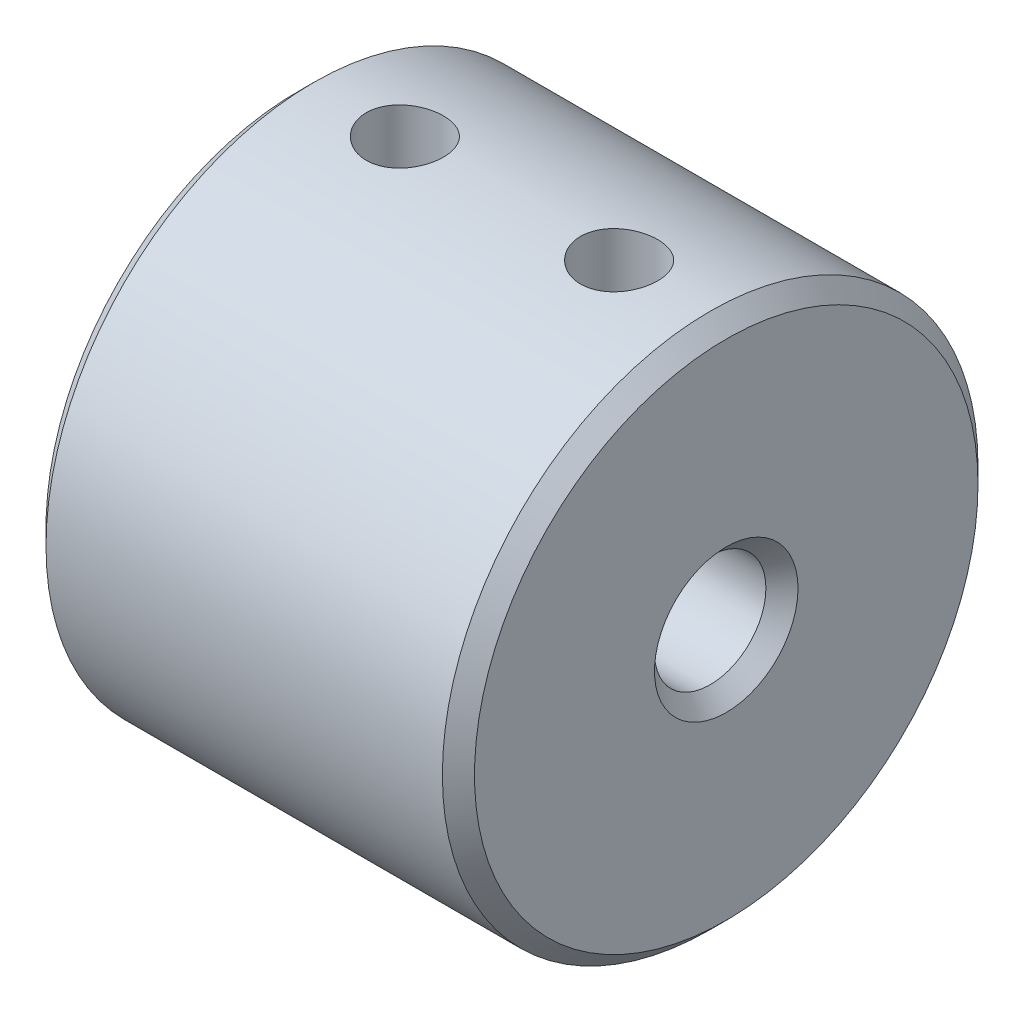
ISO-10303-21;
HEADER;
FILE_DESCRIPTION(('STEP AP214'),'2;1');
FILE_NAME('part.step','',(''),(''),'','','');
FILE_SCHEMA(('AUTOMOTIVE_DESIGN { 1 0 10303 214 1 1 1 1 }'));
ENDSEC;
DATA;
#1=APPLICATION_CONTEXT('core data for automotive mechanical design processes');
#2=APPLICATION_PROTOCOL_DEFINITION('international standard','automotive_design',2000,#1);
#3=PRODUCT_CONTEXT('',#1,'mechanical');
#4=PRODUCT('Part','Part','',(#3));
#5=PRODUCT_RELATED_PRODUCT_CATEGORY('part','',(#4));
#6=PRODUCT_DEFINITION_FORMATION('','',#4);
#7=PRODUCT_DEFINITION_CONTEXT('part definition',#1,'design');
#8=PRODUCT_DEFINITION('design','',#6,#7);
#9=PRODUCT_DEFINITION_SHAPE('','',#8);
#10=(LENGTH_UNIT() NAMED_UNIT(*) SI_UNIT(.MILLI.,.METRE.));
#11=(NAMED_UNIT(*) PLANE_ANGLE_UNIT() SI_UNIT($,.RADIAN.));
#12=(NAMED_UNIT(*) SI_UNIT($,.STERADIAN.) SOLID_ANGLE_UNIT());
#13=UNCERTAINTY_MEASURE_WITH_UNIT(LENGTH_MEASURE(1.E-05),#10,'distance_accuracy_value','');
#14=(GEOMETRIC_REPRESENTATION_CONTEXT(3) GLOBAL_UNCERTAINTY_ASSIGNED_CONTEXT((#13)) GLOBAL_UNIT_ASSIGNED_CONTEXT((#10,
#11,#12)) REPRESENTATION_CONTEXT('',''));
#15=CARTESIAN_POINT('',(0.,0.,0.));
#16=DIRECTION('',(0.,0.,1.));
#17=DIRECTION('',(1.,0.,0.));
#18=AXIS2_PLACEMENT_3D('',#15,#16,#17);
#19=CARTESIAN_POINT('',(20.,0.,0.));
#20=DIRECTION('',(-1.,0.,0.));
#21=DIRECTION('',(0.,0.,1.));
#22=AXIS2_PLACEMENT_3D('',#19,#20,#21);
#23=CYLINDRICAL_SURFACE('',#22,5.1);
#24=CARTESIAN_POINT('',(0.749999999999997,0.,0.));
#25=DIRECTION('',(1.,0.,0.));
#26=DIRECTION('',(0.,0.,-1.));
#27=AXIS2_PLACEMENT_3D('',#24,#25,#26);
#28=CIRCLE('',#27,5.1);
#29=CARTESIAN_POINT('',(0.749999999999997,0.,-5.1));
#30=VERTEX_POINT('',#29);
#31=EDGE_CURVE('E37',#30,#30,#28,.F.);
#32=ORIENTED_EDGE('',*,*,#31,.T.);
#33=EDGE_LOOP('',(#32));
#34=FACE_BOUND('',#33,.T.);
#35=CARTESIAN_POINT('',(9.25,0.,0.));
#36=DIRECTION('',(1.,0.,0.));
#37=DIRECTION('',(0.,0.,-1.));
#38=AXIS2_PLACEMENT_3D('',#35,#36,#37);
#39=CIRCLE('',#38,5.1);
#40=CARTESIAN_POINT('',(9.25,0.,-5.1));
#41=VERTEX_POINT('',#40);
#42=EDGE_CURVE('E41',#41,#41,#39,.T.);
#43=ORIENTED_EDGE('',*,*,#42,.T.);
#44=EDGE_LOOP('',(#43));
#45=FACE_BOUND('',#44,.T.);
#46=CARTESIAN_POINT('',(5.,4.77179211617606,-1.8));
#47=CARTESIAN_POINT('',(5.09766376906023,4.77179057891547,-1.80000178879937));
#48=CARTESIAN_POINT('',(5.19531510071238,4.77482311752795,-1.79202479137536));
#49=CARTESIAN_POINT('',(5.38770107288386,4.78655271745621,-1.7604521109396));
#50=CARTESIAN_POINT('',(5.48243551138635,4.79525017018996,-1.73685534867634));
#51=CARTESIAN_POINT('',(5.66616427458729,4.81720432912199,-1.6749943771612));
#52=CARTESIAN_POINT('',(5.7551704908051,4.83045120290536,-1.63676177927544));
#53=CARTESIAN_POINT('',(5.92553742459657,4.85999662432325,-1.54682439139059));
#54=CARTESIAN_POINT('',(6.00689614701902,4.87629596501395,-1.49511609892422));
#55=CARTESIAN_POINT('',(6.16323280038507,4.91091252917204,-1.37726183158472));
#56=CARTESIAN_POINT('',(6.23782641736017,4.92928432839081,-1.31062195594327));
#57=CARTESIAN_POINT('',(6.37504544253177,4.96551730444401,-1.16584743505897));
#58=CARTESIAN_POINT('',(6.43766865510809,4.98337838709248,-1.08771068569379));
#59=CARTESIAN_POINT('',(6.55096165833392,5.0172170078421,-0.919301355934873));
#60=CARTESIAN_POINT('',(6.60122189316265,5.03312298110544,-0.828737599998519));
#61=CARTESIAN_POINT('',(6.68563854416339,5.06061029961003,-0.639781542154651));
#62=CARTESIAN_POINT('',(6.71979986349648,5.07219296135548,-0.541391634500671));
#63=CARTESIAN_POINT('',(6.76972544942103,5.08934167476699,-0.343610765548326));
#64=CARTESIAN_POINT('',(6.7861495686983,5.0951229131693,-0.244405383305836));
#65=CARTESIAN_POINT('',(6.80224001283133,5.10078507932648,-0.0444894331154103));
#66=CARTESIAN_POINT('',(6.80191116958293,5.10066770836064,0.0562206924563105));
#67=CARTESIAN_POINT('',(6.78490794953763,5.09468764042003,0.251589997503374));
#68=CARTESIAN_POINT('',(6.76895182839163,5.08907740807746,0.346320714918821));
#69=CARTESIAN_POINT('',(6.72234407182109,5.0730654301282,0.531661595570342));
#70=CARTESIAN_POINT('',(6.69169141465815,5.06266335138284,0.622271471836064));
#71=CARTESIAN_POINT('',(6.61618150231363,5.03793183506246,0.79828426091064));
#72=CARTESIAN_POINT('',(6.57113297285803,5.02354988435183,0.883597433211803));
#73=CARTESIAN_POINT('',(6.46827263857434,4.99233681997265,1.04565463246261));
#74=CARTESIAN_POINT('',(6.41045700180277,4.97550497150533,1.12239607624225));
#75=CARTESIAN_POINT('',(6.28015537421303,4.94010823887679,1.26938777545075));
#76=CARTESIAN_POINT('',(6.20705966367074,4.92149875894636,1.33908761593446));
#77=CARTESIAN_POINT('',(6.05007828586402,4.88536984050398,1.465431643673));
#78=CARTESIAN_POINT('',(5.96619051465466,4.86785061553129,1.52207327916357));
#79=CARTESIAN_POINT('',(5.78806896740533,4.83562425411914,1.62158329806663));
#80=CARTESIAN_POINT('',(5.69367851202571,4.82097230408064,1.66419049980235));
#81=CARTESIAN_POINT('',(5.4984119094291,4.79677584952522,1.73270815014938));
#82=CARTESIAN_POINT('',(5.39753890644845,4.78722888956364,1.75862662708267));
#83=CARTESIAN_POINT('',(5.19755484523354,4.77488962427376,1.79185082329929));
#84=CARTESIAN_POINT('',(5.09860658395106,4.77178435305474,1.80001989980664));
#85=CARTESIAN_POINT('',(4.90072568244871,4.7717999024999,1.79998003853999));
#86=CARTESIAN_POINT('',(4.80179304334061,4.77491940899169,1.79177455775547));
#87=CARTESIAN_POINT('',(4.61090101743485,4.78671824614052,1.7599977914987));
#88=CARTESIAN_POINT('',(4.51882111637868,4.79516943997506,1.73705634276769));
#89=CARTESIAN_POINT('',(4.33984623795104,4.81641940967953,1.67723125401985));
#90=CARTESIAN_POINT('',(4.25295225105957,4.82921901296648,1.64034496042185));
#91=CARTESIAN_POINT('',(4.08348796437824,4.85826891941576,1.5522369803934));
#92=CARTESIAN_POINT('',(4.00117030274841,4.87462304828792,1.50056457496746));
#93=CARTESIAN_POINT('',(3.84606442744477,4.90875051605513,1.38484730150454));
#94=CARTESIAN_POINT('',(3.77327935599778,4.92652431982501,1.32079837093017));
#95=CARTESIAN_POINT('',(3.63516216343552,4.96266988139109,1.17797181962988));
#96=CARTESIAN_POINT('',(3.57045969565111,4.98102079897456,1.09857808462835));
#97=CARTESIAN_POINT('',(3.45523934906114,5.01530183353512,0.929606775672224));
#98=CARTESIAN_POINT('',(3.40472117741899,5.03123200048581,0.840029412013589));
#99=CARTESIAN_POINT('',(3.31971988294053,5.05882678928133,0.65352808448695));
#100=CARTESIAN_POINT('',(3.28515084345368,5.07051419209174,0.556646834318194));
#101=CARTESIAN_POINT('',(3.23296441204926,5.08839920368979,0.357945224636596));
#102=CARTESIAN_POINT('',(3.21534006850457,5.09459906368017,0.256126908598063));
#103=CARTESIAN_POINT('',(3.19822709709899,5.10062039901428,0.0561678812904945));
#104=CARTESIAN_POINT('',(3.19783922281879,5.10075813835421,-0.0418871123621515));
#105=CARTESIAN_POINT('',(3.21294855117171,5.09543940796502,-0.236600943211349));
#106=CARTESIAN_POINT('',(3.22844419192,5.08998348828108,-0.333259916736002));
#107=CARTESIAN_POINT('',(3.27426550423474,5.07422031967488,-0.520533944004099));
#108=CARTESIAN_POINT('',(3.30429477972871,5.06401017881634,-0.611230293128848));
#109=CARTESIAN_POINT('',(3.37804782521233,5.03979358973296,-0.786320926260151));
#110=CARTESIAN_POINT('',(3.4217741501304,5.02578643331155,-0.870714030874153));
#111=CARTESIAN_POINT('',(3.52366001002839,4.99471102248373,-1.03444778801292));
#112=CARTESIAN_POINT('',(3.58232182244813,4.97754364001382,-1.11345677824595));
#113=CARTESIAN_POINT('',(3.71158862951062,4.94228098773329,-1.26079665428442));
#114=CARTESIAN_POINT('',(3.78219765950707,4.92418540585314,-1.32912391712225));
#115=CARTESIAN_POINT('',(3.93717060796818,4.88811661286832,-1.45632726228402));
#116=CARTESIAN_POINT('',(4.02201282731503,4.87018610299857,-1.5146347787056));
#117=CARTESIAN_POINT('',(4.20085890838791,4.83744928699251,-1.61615028786941));
#118=CARTESIAN_POINT('',(4.29486181298267,4.82264265497619,-1.65935985592443));
#119=CARTESIAN_POINT('',(4.48902304167333,4.79811280649314,-1.72901206289136));
#120=CARTESIAN_POINT('',(4.58914922581433,4.78836523134543,-1.75553517844142));
#121=CARTESIAN_POINT('',(4.79285603357669,4.77520719099239,-1.79102407110986));
#122=CARTESIAN_POINT('',(4.89643500971325,4.77179374632386,-1.79999810311447));
#123=CARTESIAN_POINT('',(5.,4.77179211617606,-1.8));
#124=B_SPLINE_CURVE_WITH_KNOTS('',3,(#46,#47,#48,#49,#50,#51,#52,#53,#54,#55,#56,#57,#58,#59,
#60,#61,#62,#63,#64,#65,#66,#67,#68,#69,#70,#71,#72,#73,#74,#75,#76,#77,#78,#79,#80,#81,#82,#83,
#84,#85,#86,#87,#88,#89,#90,#91,#92,#93,#94,#95,#96,#97,#98,#99,#100,#101,#102,#103,#104,#105,
#106,#107,#108,#109,#110,#111,#112,#113,#114,#115,#116,#117,#118,#119,#120,#121,#122,#123),
.UNSPECIFIED.,.T.,.F.,(4,2,2,2,2,2,2,2,2,2,2,2,2,2,2,2,2,2,2,2,2,2,2,2,2,2,2,2,2,2,2,2,2,2,2,2,
2,2,4),(0.,0.292606807853152,0.585233835556623,0.877232363476269,1.16930686054357,
1.47303958765768,1.77682797230056,2.08962529938747,2.40232729778868,2.70294658797419,
3.00347917392024,3.29081740699327,3.57817561940627,3.86952279037665,4.16095752597553,
4.46765467923214,4.77441171489321,5.08659154219549,5.3986210790238,5.69509751531565,
5.99151136625202,6.27603026338114,6.56060332922519,6.85499541741665,7.14948430310949,
7.46016181324937,7.77083290894077,8.07981032248676,8.38866092269498,8.68137842279039,
8.9740671416513,9.26102343399231,9.54803328456936,9.84639021172009,10.1448481153488,
10.4568302399935,10.7687798028438,11.0792131008421,11.3895003394439),.UNSPECIFIED.);
#125=CARTESIAN_POINT('',(5.,4.77179211617606,-1.8));
#126=VERTEX_POINT('',#125);
#127=EDGE_CURVE('E71',#126,#126,#124,.T.);
#128=ORIENTED_EDGE('',*,*,#127,.F.);
#129=EDGE_LOOP('',(#128));
#130=FACE_BOUND('',#129,.T.);
#131=ADVANCED_FACE('F30',(#34,#45,#130),#23,.F.);
#132=CARTESIAN_POINT('',(20.,0.,0.));
#133=DIRECTION('',(-1.,0.,0.));
#134=DIRECTION('',(0.,0.,1.));
#135=AXIS2_PLACEMENT_3D('',#132,#133,#134);
#136=CYLINDRICAL_SURFACE('',#135,12.5);
#137=CARTESIAN_POINT('',(19.25,0.,0.));
#138=DIRECTION('',(1.,0.,0.));
#139=DIRECTION('',(0.,0.,-1.));
#140=AXIS2_PLACEMENT_3D('',#137,#138,#139);
#141=CIRCLE('',#140,12.5);
#142=CARTESIAN_POINT('',(19.25,0.,-12.5));
#143=VERTEX_POINT('',#142);
#144=EDGE_CURVE('E53',#143,#143,#141,.F.);
#145=ORIENTED_EDGE('',*,*,#144,.T.);
#146=EDGE_LOOP('',(#145));
#147=FACE_BOUND('',#146,.T.);
#148=CARTESIAN_POINT('',(0.750000000000004,0.,0.));
#149=DIRECTION('',(1.,0.,0.));
#150=DIRECTION('',(0.,0.,-1.));
#151=AXIS2_PLACEMENT_3D('',#148,#149,#150);
#152=CIRCLE('',#151,12.5);
#153=CARTESIAN_POINT('',(0.750000000000004,0.,-12.5));
#154=VERTEX_POINT('',#153);
#155=EDGE_CURVE('E56',#154,#154,#152,.T.);
#156=ORIENTED_EDGE('',*,*,#155,.T.);
#157=EDGE_LOOP('',(#156));
#158=FACE_BOUND('',#157,.T.);
#159=CARTESIAN_POINT('',(15.,12.3697210962899,-1.8));
#160=CARTESIAN_POINT('',(15.1005428120949,12.3697227235025,-1.79999581350321));
#161=CARTESIAN_POINT('',(15.2011451383508,12.3709601920709,-1.79154748128624));
#162=CARTESIAN_POINT('',(15.3995403846028,12.3757733912813,-1.75798445016031));
#163=CARTESIAN_POINT('',(15.4973304135085,12.379351444267,-1.73285319797822));
#164=CARTESIAN_POINT('',(15.687200443195,12.3884323352826,-1.66668892704142));
#165=CARTESIAN_POINT('',(15.7792846369138,12.3939337397055,-1.62566774969611));
#166=CARTESIAN_POINT('',(15.955248580602,12.406239757424,-1.52891534745888));
#167=CARTESIAN_POINT('',(16.0391295272298,12.4130441802105,-1.473186272499));
#168=CARTESIAN_POINT('',(16.1969396196247,12.4272457702168,-1.3481600729048));
#169=CARTESIAN_POINT('',(16.2707993786412,12.4346465554687,-1.27877576751347));
#170=CARTESIAN_POINT('',(16.405869675061,12.4491746388085,-1.12859682039649));
#171=CARTESIAN_POINT('',(16.4670795344057,12.4563019222195,-1.0478015674129));
#172=CARTESIAN_POINT('',(16.5753668670072,12.469517622134,-0.876651623684072));
#173=CARTESIAN_POINT('',(16.6223806999737,12.475601309157,-0.786256271136433));
#174=CARTESIAN_POINT('',(16.7005332353126,12.4860043488202,-0.598750219392736));
#175=CARTESIAN_POINT('',(16.7316727121929,12.490323787536,-0.501639848084263));
#176=CARTESIAN_POINT('',(16.7769829635994,12.496686131426,-0.304173929875819));
#177=CARTESIAN_POINT('',(16.7912697566503,12.4987445949328,-0.203845513797362));
#178=CARTESIAN_POINT('',(16.8028291607872,12.5004063312204,-0.00219567572197181));
#179=CARTESIAN_POINT('',(16.8001026469959,12.5000097302837,0.099125694932156));
#180=CARTESIAN_POINT('',(16.7778047533719,12.4968184946183,0.299094316454708));
#181=CARTESIAN_POINT('',(16.7583581796268,12.4940416277373,0.397755807783435));
#182=CARTESIAN_POINT('',(16.7033678816202,12.4864216851113,0.590400392886252));
#183=CARTESIAN_POINT('',(16.6678237698043,12.4815785596204,0.684383373962943));
#184=CARTESIAN_POINT('',(16.581518331739,12.4703396858935,0.86538307094687));
#185=CARTESIAN_POINT('',(16.5307040893758,12.4639385535447,0.952374207137674));
#186=CARTESIAN_POINT('',(16.4153394154178,12.4502977850799,1.11664190396958));
#187=CARTESIAN_POINT('',(16.3507881496002,12.4430580980521,1.19391787417381));
#188=CARTESIAN_POINT('',(16.2090855583668,12.4284708700327,1.33729673817555));
#189=CARTESIAN_POINT('',(16.1318253132983,12.4211229462699,1.40329199292284));
#190=CARTESIAN_POINT('',(15.9672689976928,12.4072116119432,1.52139655007884));
#191=CARTESIAN_POINT('',(15.8799728741811,12.4006482055207,1.57350577918497));
#192=CARTESIAN_POINT('',(15.6977148089799,12.3890492197571,1.66237147094759));
#193=CARTESIAN_POINT('',(15.6027477085336,12.3840146795972,1.69911749748981));
#194=CARTESIAN_POINT('',(15.4079014917174,12.3760622957337,1.75610871713495));
#195=CARTESIAN_POINT('',(15.3080226935672,12.3731443150946,1.77635497773724));
#196=CARTESIAN_POINT('',(15.1071441529418,12.3697811923285,1.79962562985453));
#197=CARTESIAN_POINT('',(15.006162406867,12.3693141824996,1.80280232313277));
#198=CARTESIAN_POINT('',(14.805108026663,12.3708478798753,1.79224721070787));
#199=CARTESIAN_POINT('',(14.7050353666903,12.3728485167071,1.77851588719038));
#200=CARTESIAN_POINT('',(14.5091077249187,12.3790720339847,1.73466345948928));
#201=CARTESIAN_POINT('',(14.4132355298447,12.3832846976609,1.70461768588771));
#202=CARTESIAN_POINT('',(14.2278885492244,12.3934492231037,1.62906739696318));
#203=CARTESIAN_POINT('',(14.1384140569111,12.399401164525,1.58356217361882));
#204=CARTESIAN_POINT('',(13.9677179819194,12.412425357477,1.47801660711231));
#205=CARTESIAN_POINT('',(13.8865581461535,12.4195051150269,1.41787734429659));
#206=CARTESIAN_POINT('',(13.7354287494532,12.4339643878259,1.28490893571823));
#207=CARTESIAN_POINT('',(13.6654597705677,12.4413439186414,1.21207913031781));
#208=CARTESIAN_POINT('',(13.5381543480181,12.455639304166,1.05512764895846));
#209=CARTESIAN_POINT('',(13.4809186205902,12.462551180617,0.970923865308856));
#210=CARTESIAN_POINT('',(13.3814048746635,12.4750712772722,0.794008470959913));
#211=CARTESIAN_POINT('',(13.3391264734878,12.4806795308277,0.701297078000585));
#212=CARTESIAN_POINT('',(13.2708898230851,12.489942999375,0.510317801907362));
#213=CARTESIAN_POINT('',(13.2448757066572,12.4936048934678,0.412070217637296));
#214=CARTESIAN_POINT('',(13.2097250071135,12.4985910104536,0.212544784881353));
#215=CARTESIAN_POINT('',(13.2005874003897,12.4999153751243,0.111267120557081));
#216=CARTESIAN_POINT('',(13.1994725862613,12.5000759865022,-0.0904650846970294));
#217=CARTESIAN_POINT('',(13.2073409754363,12.4989346204882,-0.190918788894322));
#218=CARTESIAN_POINT('',(13.239684850497,12.4943369837254,-0.389059243808334));
#219=CARTESIAN_POINT('',(13.2641602950619,12.4908807187364,-0.486746001408989));
#220=CARTESIAN_POINT('',(13.3289702989691,12.482039798096,-0.676542807722346));
#221=CARTESIAN_POINT('',(13.3692949980029,12.4766563415951,-0.768656282709338));
#222=CARTESIAN_POINT('',(13.4646425465765,12.4645535624185,-0.94483387729621));
#223=CARTESIAN_POINT('',(13.5196657974462,12.4578342032686,-1.02889777702506));
#224=CARTESIAN_POINT('',(13.6434103318197,12.4437347622854,-1.18737470227099));
#225=CARTESIAN_POINT('',(13.7122458858945,12.4363494722508,-1.26169804535098));
#226=CARTESIAN_POINT('',(13.8614208761959,12.4217898987461,-1.3977957069774));
#227=CARTESIAN_POINT('',(13.941763013132,12.414615665291,-1.45956707119362));
#228=CARTESIAN_POINT('',(14.1121550594135,12.4012509274175,-1.56909029361445));
#229=CARTESIAN_POINT('',(14.2022528620216,12.3950656829494,-1.61676826498914));
#230=CARTESIAN_POINT('',(14.38922188294,12.3844408378049,-1.69624496167778));
#231=CARTESIAN_POINT('',(14.4860858623132,12.3799994041743,-1.72806036999367));
#232=CARTESIAN_POINT('',(14.65283556663,12.3744047115493,-1.76758591631181));
#233=CARTESIAN_POINT('',(14.7216853429327,12.3726575208894,-1.77972289128651));
#234=CARTESIAN_POINT('',(14.8603471812312,12.3703151546889,-1.79593134103888));
#235=CARTESIAN_POINT('',(14.9301592322081,12.3697199659677,-1.80000290809601));
#236=CARTESIAN_POINT('',(15.,12.3697210962899,-1.8));
#237=B_SPLINE_CURVE_WITH_KNOTS('',3,(#159,#160,#161,#162,#163,#164,#165,#166,#167,#168,#169,
#170,#171,#172,#173,#174,#175,#176,#177,#178,#179,#180,#181,#182,#183,#184,#185,#186,#187,#188,
#189,#190,#191,#192,#193,#194,#195,#196,#197,#198,#199,#200,#201,#202,#203,#204,#205,#206,#207,
#208,#209,#210,#211,#212,#213,#214,#215,#216,#217,#218,#219,#220,#221,#222,#223,#224,#225,#226,
#227,#228,#229,#230,#231,#232,#233,#234,#235,#236),.UNSPECIFIED.,.T.,.F.,(4,2,2,2,2,2,2,2,2,2,2,
2,2,2,2,2,2,2,2,2,2,2,2,2,2,2,2,2,2,2,2,2,2,2,2,2,2,2,4),(0.,0.301373196903124,
0.603045872818594,0.904494168915708,1.20589842508561,1.50929333955632,1.81270451235602,
2.11745633499678,2.42219328740749,2.72481987056543,3.02743088748528,3.32780249730477,
3.62818133907058,3.92961333854333,4.23106364862669,4.53524672611095,4.83943140930739,
5.14382238858674,5.44819367286064,5.74984466482385,6.05148705445259,6.35174833556748,
6.65202337008742,6.95438744547406,7.2567672420404,7.56145985969634,7.86614468135712,
8.16977708776322,8.4733910773981,8.77426003658384,9.07512824716665,9.37580957391357,
9.67649911131304,9.97978724398399,10.2831466784067,10.5880694083441,10.8926707643569,
11.1020181642262,11.311363168857),.UNSPECIFIED.);
#238=CARTESIAN_POINT('',(15.,12.3697210962899,-1.8));
#239=VERTEX_POINT('',#238);
#240=EDGE_CURVE('E81',#239,#239,#237,.T.);
#241=ORIENTED_EDGE('',*,*,#240,.T.);
#242=EDGE_LOOP('',(#241));
#243=FACE_BOUND('',#242,.T.);
#244=CARTESIAN_POINT('',(5.,12.3697210962899,-1.8));
#245=CARTESIAN_POINT('',(5.10054281209491,12.3697227235025,-1.79999581350321));
#246=CARTESIAN_POINT('',(5.20114513835079,12.3709601920709,-1.79154748128624));
#247=CARTESIAN_POINT('',(5.39954038460275,12.3757733912814,-1.75798445016031));
#248=CARTESIAN_POINT('',(5.4973304135085,12.379351444267,-1.73285319797822));
#249=CARTESIAN_POINT('',(5.687200443195,12.3884323352826,-1.66668892704142));
#250=CARTESIAN_POINT('',(5.77928463691382,12.3939337397055,-1.62566774969611));
#251=CARTESIAN_POINT('',(5.95524858060204,12.406239757424,-1.52891534745887));
#252=CARTESIAN_POINT('',(6.03912952722984,12.4130441802105,-1.473186272499));
#253=CARTESIAN_POINT('',(6.19693961962474,12.4272457702168,-1.3481600729048));
#254=CARTESIAN_POINT('',(6.2707993786412,12.4346465554687,-1.27877576751347));
#255=CARTESIAN_POINT('',(6.40586967506102,12.4491746388085,-1.12859682039649));
#256=CARTESIAN_POINT('',(6.46707953440569,12.4563019222195,-1.0478015674129));
#257=CARTESIAN_POINT('',(6.57536686700716,12.469517622134,-0.876651623684068));
#258=CARTESIAN_POINT('',(6.62238069997371,12.475601309157,-0.786256271136429));
#259=CARTESIAN_POINT('',(6.70053323531255,12.4860043488202,-0.598750219392732));
#260=CARTESIAN_POINT('',(6.73167271219286,12.490323787536,-0.501639848084259));
#261=CARTESIAN_POINT('',(6.77698296359938,12.496686131426,-0.304173929875815));
#262=CARTESIAN_POINT('',(6.79126975665025,12.4987445949328,-0.203845513797358));
#263=CARTESIAN_POINT('',(6.8028291607872,12.5004063312204,-0.00219567572196867));
#264=CARTESIAN_POINT('',(6.8001026469959,12.5000097302837,0.0991256949321588));
#265=CARTESIAN_POINT('',(6.77780475337189,12.4968184946183,0.29909431645471));
#266=CARTESIAN_POINT('',(6.75835817962675,12.4940416277373,0.397755807783438));
#267=CARTESIAN_POINT('',(6.70336788162018,12.4864216851113,0.590400392886254));
#268=CARTESIAN_POINT('',(6.66782376980434,12.4815785596204,0.684383373962946));
#269=CARTESIAN_POINT('',(6.58151833173897,12.4703396858935,0.865383070946873));
#270=CARTESIAN_POINT('',(6.53070408937576,12.4639385535447,0.952374207137676));
#271=CARTESIAN_POINT('',(6.41533941541783,12.4502977850799,1.11664190396959));
#272=CARTESIAN_POINT('',(6.35078814960016,12.4430580980521,1.19391787417381));
#273=CARTESIAN_POINT('',(6.20908555836682,12.4284708700327,1.33729673817555));
#274=CARTESIAN_POINT('',(6.13182531329834,12.4211229462699,1.40329199292284));
#275=CARTESIAN_POINT('',(5.96726899769282,12.4072116119432,1.52139655007884));
#276=CARTESIAN_POINT('',(5.87997287418112,12.4006482055207,1.57350577918497));
#277=CARTESIAN_POINT('',(5.69771480897988,12.3890492197571,1.66237147094759));
#278=CARTESIAN_POINT('',(5.60274770853362,12.3840146795972,1.69911749748982));
#279=CARTESIAN_POINT('',(5.40790149171742,12.3760622957337,1.75610871713496));
#280=CARTESIAN_POINT('',(5.30802269356717,12.3731443150946,1.77635497773724));
#281=CARTESIAN_POINT('',(5.10714415294178,12.3697811923285,1.79962562985453));
#282=CARTESIAN_POINT('',(5.00616240686704,12.3693141824996,1.80280232313277));
#283=CARTESIAN_POINT('',(4.80510802666304,12.3708478798753,1.79224721070787));
#284=CARTESIAN_POINT('',(4.70503536669029,12.3728485167071,1.77851588719038));
#285=CARTESIAN_POINT('',(4.50910772491872,12.3790720339847,1.73466345948928));
#286=CARTESIAN_POINT('',(4.41323552984473,12.3832846976609,1.70461768588771));
#287=CARTESIAN_POINT('',(4.22788854922435,12.3934492231037,1.62906739696318));
#288=CARTESIAN_POINT('',(4.13841405691111,12.399401164525,1.58356217361882));
#289=CARTESIAN_POINT('',(3.96771798191941,12.412425357477,1.47801660711231));
#290=CARTESIAN_POINT('',(3.88655814615349,12.4195051150269,1.41787734429659));
#291=CARTESIAN_POINT('',(3.73542874945319,12.4339643878259,1.28490893571823));
#292=CARTESIAN_POINT('',(3.66545977056765,12.4413439186414,1.21207913031781));
#293=CARTESIAN_POINT('',(3.53815434801805,12.455639304166,1.05512764895846));
#294=CARTESIAN_POINT('',(3.48091862059019,12.462551180617,0.970923865308857));
#295=CARTESIAN_POINT('',(3.38140487466349,12.4750712772722,0.794008470959914));
#296=CARTESIAN_POINT('',(3.33912647348782,12.4806795308277,0.701297078000586));
#297=CARTESIAN_POINT('',(3.2708898230851,12.489942999375,0.510317801907362));
#298=CARTESIAN_POINT('',(3.24487570665715,12.4936048934678,0.412070217637297));
#299=CARTESIAN_POINT('',(3.20972500711353,12.4985910104536,0.212544784881354));
#300=CARTESIAN_POINT('',(3.20058740038969,12.4999153751243,0.111267120557082));
#301=CARTESIAN_POINT('',(3.19947258626135,12.5000759865022,-0.0904650846970293));
#302=CARTESIAN_POINT('',(3.20734097543634,12.4989346204882,-0.190918788894322));
#303=CARTESIAN_POINT('',(3.239684850497,12.4943369837254,-0.389059243808334));
#304=CARTESIAN_POINT('',(3.2641602950619,12.4908807187364,-0.486746001408988));
#305=CARTESIAN_POINT('',(3.32897029896909,12.482039798096,-0.676542807722346));
#306=CARTESIAN_POINT('',(3.36929499800287,12.4766563415951,-0.768656282709338));
#307=CARTESIAN_POINT('',(3.46464254657655,12.4645535624185,-0.94483387729621));
#308=CARTESIAN_POINT('',(3.51966579744621,12.4578342032686,-1.02889777702506));
#309=CARTESIAN_POINT('',(3.6434103318197,12.4437347622854,-1.18737470227099));
#310=CARTESIAN_POINT('',(3.71224588589445,12.4363494722508,-1.26169804535098));
#311=CARTESIAN_POINT('',(3.86142087619594,12.4217898987461,-1.3977957069774));
#312=CARTESIAN_POINT('',(3.94176301313197,12.414615665291,-1.45956707119362));
#313=CARTESIAN_POINT('',(4.11215505941347,12.4012509274175,-1.56909029361445));
#314=CARTESIAN_POINT('',(4.20225286202156,12.3950656829494,-1.61676826498914));
#315=CARTESIAN_POINT('',(4.38922188293999,12.3844408378049,-1.69624496167778));
#316=CARTESIAN_POINT('',(4.48608586231324,12.3799994041743,-1.72806036999367));
#317=CARTESIAN_POINT('',(4.65283556663003,12.3744047115493,-1.76758591631181));
#318=CARTESIAN_POINT('',(4.72168534293268,12.3726575208894,-1.77972289128651));
#319=CARTESIAN_POINT('',(4.8603471812312,12.3703151546889,-1.79593134103888));
#320=CARTESIAN_POINT('',(4.93015923220812,12.3697199659677,-1.800002908096));
#321=CARTESIAN_POINT('',(5.,12.3697210962899,-1.8));
#322=B_SPLINE_CURVE_WITH_KNOTS('',3,(#244,#245,#246,#247,#248,#249,#250,#251,#252,#253,#254,
#255,#256,#257,#258,#259,#260,#261,#262,#263,#264,#265,#266,#267,#268,#269,#270,#271,#272,#273,
#274,#275,#276,#277,#278,#279,#280,#281,#282,#283,#284,#285,#286,#287,#288,#289,#290,#291,#292,
#293,#294,#295,#296,#297,#298,#299,#300,#301,#302,#303,#304,#305,#306,#307,#308,#309,#310,#311,
#312,#313,#314,#315,#316,#317,#318,#319,#320,#321),.UNSPECIFIED.,.T.,.F.,(4,2,2,2,2,2,2,2,2,2,2,
2,2,2,2,2,2,2,2,2,2,2,2,2,2,2,2,2,2,2,2,2,2,2,2,2,2,2,4),(0.,0.301373196903125,
0.603045872818595,0.904494168915708,1.20589842508561,1.50929333955633,1.81270451235603,
2.11745633499679,2.42219328740749,2.72481987056543,3.02743088748528,3.32780249730477,
3.62818133907058,3.92961333854333,4.23106364862669,4.53524672611095,4.83943140930739,
5.14382238858674,5.44819367286064,5.74984466482386,6.05148705445259,6.35174833556748,
6.65202337008742,6.95438744547406,7.2567672420404,7.56145985969634,7.86614468135712,
8.16977708776322,8.47339107739811,8.77426003658384,9.07512824716665,9.37580957391357,
9.67649911131305,9.97978724398399,10.2831466784067,10.5880694083441,10.8926707643569,
11.1020181642262,11.311363168857),.UNSPECIFIED.);
#323=CARTESIAN_POINT('',(5.,12.3697210962899,-1.8));
#324=VERTEX_POINT('',#323);
#325=EDGE_CURVE('E80',#324,#324,#322,.T.);
#326=ORIENTED_EDGE('',*,*,#325,.T.);
#327=EDGE_LOOP('',(#326));
#328=FACE_BOUND('',#327,.T.);
#329=ADVANCED_FACE('F97',(#147,#158,#243,#328),#136,.T.);
#330=CARTESIAN_POINT('',(10.,0.,0.));
#331=DIRECTION('',(1.,0.,0.));
#332=DIRECTION('',(0.,0.,-1.));
#333=AXIS2_PLACEMENT_3D('',#330,#331,#332);
#334=CYLINDRICAL_SURFACE('',#333,2.6);
#335=CARTESIAN_POINT('',(19.25,0.,0.));
#336=DIRECTION('',(1.,0.,0.));
#337=DIRECTION('',(0.,0.,-1.));
#338=AXIS2_PLACEMENT_3D('',#335,#336,#337);
#339=CIRCLE('',#338,2.6);
#340=CARTESIAN_POINT('',(19.25,0.,-2.6));
#341=VERTEX_POINT('',#340);
#342=EDGE_CURVE('E65',#341,#341,#339,.T.);
#343=ORIENTED_EDGE('',*,*,#342,.T.);
#344=EDGE_LOOP('',(#343));
#345=FACE_BOUND('',#344,.T.);
#346=CARTESIAN_POINT('',(10.,0.,0.));
#347=DIRECTION('',(1.,0.,0.));
#348=DIRECTION('',(0.,0.,-1.));
#349=AXIS2_PLACEMENT_3D('',#346,#347,#348);
#350=CIRCLE('',#349,2.6);
#351=CARTESIAN_POINT('',(10.,0.,-2.6));
#352=VERTEX_POINT('',#351);
#353=EDGE_CURVE('E68',#352,#352,#350,.T.);
#354=ORIENTED_EDGE('',*,*,#353,.F.);
#355=EDGE_LOOP('',(#354));
#356=FACE_BOUND('',#355,.T.);
#357=CARTESIAN_POINT('',(15.,1.87616630392937,-1.8));
#358=CARTESIAN_POINT('',(14.913261585116,1.87617641360866,-1.79999465432342));
#359=CARTESIAN_POINT('',(14.8264894992195,1.88230056381342,-1.79367140089586));
#360=CARTESIAN_POINT('',(14.6561372802687,1.905531901044,-1.76895755947071));
#361=CARTESIAN_POINT('',(14.5725644512698,1.92266279696577,-1.75054092002781));
#362=CARTESIAN_POINT('',(14.4116838061496,1.96472082556983,-1.70318879532992));
#363=CARTESIAN_POINT('',(14.3343186314543,1.98956277551433,-1.67436770511892));
#364=CARTESIAN_POINT('',(14.185686228332,2.04409383027156,-1.60734135974697));
#365=CARTESIAN_POINT('',(14.1144196668777,2.07378346421947,-1.56913507994239));
#366=CARTESIAN_POINT('',(13.9667074860937,2.14071104690024,-1.47686468536507));
#367=CARTESIAN_POINT('',(13.8914489640692,2.17837311495893,-1.42120771441637));
#368=CARTESIAN_POINT('',(13.7502835783485,2.25349166388204,-1.2988243826236));
#369=CARTESIAN_POINT('',(13.6843879872787,2.29094784559984,-1.2320848848997));
#370=CARTESIAN_POINT('',(13.553237078459,2.36852129220442,-1.07648921531977));
#371=CARTESIAN_POINT('',(13.4897993750695,2.40809331501119,-0.985802034511425));
#372=CARTESIAN_POINT('',(13.379687328517,2.47863498547202,-0.79180499265166));
#373=CARTESIAN_POINT('',(13.3329803480596,2.50962135445213,-0.688520239935334));
#374=CARTESIAN_POINT('',(13.2690747619953,2.55258873940492,-0.500963518748712));
#375=CARTESIAN_POINT('',(13.2473399265661,2.56742825614682,-0.418880331787749));
#376=CARTESIAN_POINT('',(13.2156220833799,2.58918281600722,-0.251464567130315));
#377=CARTESIAN_POINT('',(13.205629816865,2.59610410236249,-0.166134604329436));
#378=CARTESIAN_POINT('',(13.1979555505197,2.60141436420817,0.00550515649176086));
#379=CARTESIAN_POINT('',(13.2002963134106,2.59978756275117,0.0918164727185755));
#380=CARTESIAN_POINT('',(13.2171978560959,2.58811644814854,0.262657753150594));
#381=CARTESIAN_POINT('',(13.2317621146864,2.57806973870568,0.347187203216926));
#382=CARTESIAN_POINT('',(13.27187062007,2.55072971952068,0.510378451578593));
#383=CARTESIAN_POINT('',(13.2971760396431,2.53359422609048,0.589126555688654));
#384=CARTESIAN_POINT('',(13.3576053098593,2.49338178538969,0.741103568473731));
#385=CARTESIAN_POINT('',(13.3927310603574,2.470303688523,0.814331405706312));
#386=CARTESIAN_POINT('',(13.4760923125428,2.41684830702651,0.962130040481922));
#387=CARTESIAN_POINT('',(13.5253580813485,2.38594195387178,1.03592518824375));
#388=CARTESIAN_POINT('',(13.6332973238321,2.32078080256527,1.1746767477509));
#389=CARTESIAN_POINT('',(13.6919812192452,2.28652231165146,1.23962321895969));
#390=CARTESIAN_POINT('',(13.8288061687869,2.21085521803182,1.37069107689124));
#391=CARTESIAN_POINT('',(13.9085547737902,2.16924565161816,1.43502401795255));
#392=CARTESIAN_POINT('',(14.0787840162712,2.08878266518571,1.54980342410326));
#393=CARTESIAN_POINT('',(14.1692607109345,2.04992824092835,1.6002549684215));
#394=CARTESIAN_POINT('',(14.3377967566771,1.9884418068318,1.67567648228328));
#395=CARTESIAN_POINT('',(14.4138051779021,1.96414142543775,1.70384676807738));
#396=CARTESIAN_POINT('',(14.5707745275761,1.92315561627839,1.7499803412902));
#397=CARTESIAN_POINT('',(14.6517259096871,1.90645600571792,1.76796265462147));
#398=CARTESIAN_POINT('',(14.8176386988867,1.88321073642484,1.79271514152164));
#399=CARTESIAN_POINT('',(14.9026306360186,1.87676195276787,1.79937838463526));
#400=CARTESIAN_POINT('',(15.0727717741176,1.87565127582246,1.80053758115998));
#401=CARTESIAN_POINT('',(15.1579209382556,1.88098690417791,1.7950360929111));
#402=CARTESIAN_POINT('',(15.3143453511453,1.90093504468173,1.77386804683442));
#403=CARTESIAN_POINT('',(15.3859919527487,1.91426018956967,1.75960635475683));
#404=CARTESIAN_POINT('',(15.5256900707835,1.94723746212571,1.72304147428596));
#405=CARTESIAN_POINT('',(15.5937379131898,1.96689591574229,1.70073024302613));
#406=CARTESIAN_POINT('',(15.7561554412007,2.02075490063783,1.63676559873698));
#407=CARTESIAN_POINT('',(15.8480496286773,2.05746669602729,1.59094237470519));
#408=CARTESIAN_POINT('',(16.0216922535845,2.13489953933902,1.48542974061504));
#409=CARTESIAN_POINT('',(16.10342072181,2.17562820516901,1.42571368004555));
#410=CARTESIAN_POINT('',(16.2571909230632,2.25748431462383,1.2922847222539));
#411=CARTESIAN_POINT('',(16.3290445148775,2.29860677896874,1.21835128346584));
#412=CARTESIAN_POINT('',(16.4598805070308,2.37665821494985,1.058026826811));
#413=CARTESIAN_POINT('',(16.5188823425519,2.41359347757684,0.971654952349501));
#414=CARTESIAN_POINT('',(16.6133049154113,2.4742025700928,0.803088683246168));
#415=CARTESIAN_POINT('',(16.6510188695721,2.49906113231845,0.722609790786258));
#416=CARTESIAN_POINT('',(16.7145508512992,2.5414804605734,0.555255801750637));
#417=CARTESIAN_POINT('',(16.7403762794159,2.55904576595053,0.468384723453682));
#418=CARTESIAN_POINT('',(16.7788501588994,2.58536427822382,0.289932781874529));
#419=CARTESIAN_POINT('',(16.7914270885477,2.59406964649827,0.198329127472018));
#420=CARTESIAN_POINT('',(16.8023131009553,2.60159860226202,0.0138770372312543));
#421=CARTESIAN_POINT('',(16.8006267784183,2.60042537200176,-0.0789709881285319));
#422=CARTESIAN_POINT('',(16.7839255604568,2.58889195261366,-0.254273795989359));
#423=CARTESIAN_POINT('',(16.7701349977122,2.57937574674387,-0.33690669381079));
#424=CARTESIAN_POINT('',(16.7316246085261,2.55310127123473,-0.498365514289924));
#425=CARTESIAN_POINT('',(16.7069026132576,2.53634156447935,-0.577190678038259));
#426=CARTESIAN_POINT('',(16.6464028771633,2.49601939851099,-0.732524533311407));
#427=CARTESIAN_POINT('',(16.6102136622718,2.47220635213125,-0.808805991137937));
#428=CARTESIAN_POINT('',(16.5284773409429,2.41976474503602,-0.954321568020956));
#429=CARTESIAN_POINT('',(16.4829282785464,2.39113517802294,-1.02355420953274));
#430=CARTESIAN_POINT('',(16.3757662355325,2.32607722683395,-1.16460332636964));
#431=CARTESIAN_POINT('',(16.3127537242578,2.28913027804189,-1.23511638992522));
#432=CARTESIAN_POINT('',(16.1767915379765,2.21396150548348,-1.36529981673581));
#433=CARTESIAN_POINT('',(16.1038204176711,2.17573706865604,-1.42494611345921));
#434=CARTESIAN_POINT('',(15.9372385452897,2.09577416530654,-1.54056896729331));
#435=CARTESIAN_POINT('',(15.8421716759459,2.05435440409157,-1.59469177410288));
#436=CARTESIAN_POINT('',(15.6409875091715,1.98046409966526,-1.6855886217221));
#437=CARTESIAN_POINT('',(15.5349116737222,1.94796154569019,-1.72242506435971));
#438=CARTESIAN_POINT('',(15.356129691105,1.90849912606249,-1.76582574533764));
#439=CARTESIAN_POINT('',(15.2860261222639,1.89652703599739,-1.77857256462382));
#440=CARTESIAN_POINT('',(15.1439545661179,1.88036101674539,-1.79565695087168));
#441=CARTESIAN_POINT('',(15.071988879749,1.87615791336231,-1.80000443666475));
#442=CARTESIAN_POINT('',(15.,1.87616630392937,-1.8));
#443=B_SPLINE_CURVE_WITH_KNOTS('',3,(#357,#358,#359,#360,#361,#362,#363,#364,#365,#366,#367,
#368,#369,#370,#371,#372,#373,#374,#375,#376,#377,#378,#379,#380,#381,#382,#383,#384,#385,#386,
#387,#388,#389,#390,#391,#392,#393,#394,#395,#396,#397,#398,#399,#400,#401,#402,#403,#404,#405,
#406,#407,#408,#409,#410,#411,#412,#413,#414,#415,#416,#417,#418,#419,#420,#421,#422,#423,#424,
#425,#426,#427,#428,#429,#430,#431,#432,#433,#434,#435,#436,#437,#438,#439,#440,#441,#442),
.UNSPECIFIED.,.T.,.F.,(4,2,2,2,2,2,2,2,2,2,2,2,2,2,2,2,2,2,2,2,2,2,2,2,2,2,2,2,2,2,2,2,2,2,2,2,
2,2,2,2,2,2,4),(0.,0.259873942276733,0.520309546919279,0.777964818059316,1.03564823165287,
1.3372449642885,1.63920178618408,1.98986268819495,2.33983576802311,2.59732122524117,
2.85460352431537,3.1123608481604,3.37019155439837,3.62256723909243,3.87499178256604,
4.15581313641836,4.43694740651638,4.76734625172421,5.09762404212122,5.35058983679976,
5.6030816505063,5.85794573792951,6.1127562305004,6.3346517083112,6.55676951448078,
6.88218117675335,7.2082222969687,7.53980211903043,7.87087697060286,8.14660443636829,
8.42216003023519,8.69919569819589,8.97614212645916,9.22793785542419,9.47978356380044,
9.74194786638343,10.0041670101466,10.3075895635817,10.6116761452322,10.9608264917683,
11.3087065606669,11.52464509426,11.7403284682931),.UNSPECIFIED.);
#444=CARTESIAN_POINT('',(15.,1.87616630392937,-1.8));
#445=VERTEX_POINT('',#444);
#446=EDGE_CURVE('E72',#445,#445,#443,.T.);
#447=ORIENTED_EDGE('',*,*,#446,.T.);
#448=EDGE_LOOP('',(#447));
#449=FACE_BOUND('',#448,.T.);
#450=ADVANCED_FACE('F93',(#345,#356,#449),#334,.F.);
#451=CARTESIAN_POINT('',(20.,0.,0.));
#452=DIRECTION('',(1.,0.,0.));
#453=DIRECTION('',(0.,0.,-1.));
#454=AXIS2_PLACEMENT_3D('',#451,#452,#453);
#455=PLANE('',#454);
#456=CARTESIAN_POINT('',(20.,0.,0.));
#457=DIRECTION('',(1.,0.,0.));
#458=DIRECTION('',(0.,0.,-1.));
#459=AXIS2_PLACEMENT_3D('',#456,#457,#458);
#460=CIRCLE('',#459,3.35);
#461=CARTESIAN_POINT('',(20.,0.,-3.35));
#462=VERTEX_POINT('',#461);
#463=EDGE_CURVE('E59',#462,#462,#460,.F.);
#464=ORIENTED_EDGE('',*,*,#463,.T.);
#465=EDGE_LOOP('',(#464));
#466=FACE_BOUND('',#465,.T.);
#467=CARTESIAN_POINT('',(20.,0.,0.));
#468=DIRECTION('',(1.,0.,0.));
#469=DIRECTION('',(0.,0.,-1.));
#470=AXIS2_PLACEMENT_3D('',#467,#468,#469);
#471=CIRCLE('',#470,11.75);
#472=CARTESIAN_POINT('',(20.,0.,-11.75));
#473=VERTEX_POINT('',#472);
#474=EDGE_CURVE('E62',#473,#473,#471,.T.);
#475=ORIENTED_EDGE('',*,*,#474,.T.);
#476=EDGE_LOOP('',(#475));
#477=FACE_BOUND('',#476,.T.);
#478=ADVANCED_FACE('F96',(#466,#477),#455,.T.);
#479=CARTESIAN_POINT('',(0.,0.,0.));
#480=DIRECTION('',(1.,0.,0.));
#481=DIRECTION('',(0.,0.,-1.));
#482=AXIS2_PLACEMENT_3D('',#479,#480,#481);
#483=PLANE('',#482);
#484=CARTESIAN_POINT('',(0.,0.,0.));
#485=DIRECTION('',(1.,0.,0.));
#486=DIRECTION('',(0.,0.,-1.));
#487=AXIS2_PLACEMENT_3D('',#484,#485,#486);
#488=CIRCLE('',#487,5.85);
#489=CARTESIAN_POINT('',(0.,0.,-5.85));
#490=VERTEX_POINT('',#489);
#491=EDGE_CURVE('E45',#490,#490,#488,.T.);
#492=ORIENTED_EDGE('',*,*,#491,.T.);
#493=EDGE_LOOP('',(#492));
#494=FACE_BOUND('',#493,.T.);
#495=CARTESIAN_POINT('',(0.,0.,0.));
#496=DIRECTION('',(1.,0.,0.));
#497=DIRECTION('',(0.,0.,-1.));
#498=AXIS2_PLACEMENT_3D('',#495,#496,#497);
#499=CIRCLE('',#498,11.75);
#500=CARTESIAN_POINT('',(0.,0.,-11.75));
#501=VERTEX_POINT('',#500);
#502=EDGE_CURVE('E50',#501,#501,#499,.F.);
#503=ORIENTED_EDGE('',*,*,#502,.T.);
#504=EDGE_LOOP('',(#503));
#505=FACE_BOUND('',#504,.T.);
#506=ADVANCED_FACE('F102',(#494,#505),#483,.F.);
#507=CARTESIAN_POINT('',(10.,0.,0.));
#508=DIRECTION('',(1.,0.,0.));
#509=DIRECTION('',(0.,0.,-1.));
#510=AXIS2_PLACEMENT_3D('',#507,#508,#509);
#511=PLANE('',#510);
#512=CARTESIAN_POINT('',(10.,0.,0.));
#513=DIRECTION('',(1.,0.,0.));
#514=DIRECTION('',(0.,0.,-1.));
#515=AXIS2_PLACEMENT_3D('',#512,#513,#514);
#516=CIRCLE('',#515,4.35000000000001);
#517=CARTESIAN_POINT('',(10.,0.,-4.35000000000001));
#518=VERTEX_POINT('',#517);
#519=EDGE_CURVE('E10',#518,#518,#516,.F.);
#520=ORIENTED_EDGE('',*,*,#519,.T.);
#521=EDGE_LOOP('',(#520));
#522=FACE_BOUND('',#521,.T.);
#523=ORIENTED_EDGE('',*,*,#353,.T.);
#524=EDGE_LOOP('',(#523));
#525=FACE_BOUND('',#524,.T.);
#526=ADVANCED_FACE('F99',(#522,#525),#511,.F.);
#527=CARTESIAN_POINT('',(15.,12.501,0.));
#528=DIRECTION('',(0.,-1.,0.));
#529=DIRECTION('',(0.,0.,-1.));
#530=AXIS2_PLACEMENT_3D('',#527,#528,#529);
#531=CYLINDRICAL_SURFACE('',#530,1.8);
#532=ORIENTED_EDGE('',*,*,#446,.F.);
#533=EDGE_LOOP('',(#532));
#534=FACE_BOUND('',#533,.T.);
#535=ORIENTED_EDGE('',*,*,#240,.F.);
#536=EDGE_LOOP('',(#535));
#537=FACE_BOUND('',#536,.T.);
#538=ADVANCED_FACE('F87',(#534,#537),#531,.F.);
#539=CARTESIAN_POINT('',(5.,12.501,0.));
#540=DIRECTION('',(0.,-1.,0.));
#541=DIRECTION('',(0.,0.,-1.));
#542=AXIS2_PLACEMENT_3D('',#539,#540,#541);
#543=CYLINDRICAL_SURFACE('',#542,1.8);
#544=ORIENTED_EDGE('',*,*,#127,.T.);
#545=EDGE_LOOP('',(#544));
#546=FACE_BOUND('',#545,.T.);
#547=ORIENTED_EDGE('',*,*,#325,.F.);
#548=EDGE_LOOP('',(#547));
#549=FACE_BOUND('',#548,.T.);
#550=ADVANCED_FACE('F118',(#546,#549),#543,.F.);
#551=CARTESIAN_POINT('',(19.25,0.,0.));
#552=DIRECTION('',(1.,0.,0.));
#553=DIRECTION('',(0.,0.,-1.));
#554=AXIS2_PLACEMENT_3D('',#551,#552,#553);
#555=CONICAL_SURFACE('',#554,2.6,0.78539816339745);
#556=ORIENTED_EDGE('',*,*,#463,.F.);
#557=EDGE_LOOP('',(#556));
#558=FACE_BOUND('',#557,.T.);
#559=ORIENTED_EDGE('',*,*,#342,.F.);
#560=EDGE_LOOP('',(#559));
#561=FACE_BOUND('',#560,.T.);
#562=ADVANCED_FACE('F114',(#558,#561),#555,.F.);
#563=CARTESIAN_POINT('',(20.,0.,0.));
#564=DIRECTION('',(-1.,0.,0.));
#565=DIRECTION('',(0.,0.,1.));
#566=AXIS2_PLACEMENT_3D('',#563,#564,#565);
#567=CONICAL_SURFACE('',#566,11.75,0.78539816339744);
#568=ORIENTED_EDGE('',*,*,#144,.F.);
#569=EDGE_LOOP('',(#568));
#570=FACE_BOUND('',#569,.T.);
#571=ORIENTED_EDGE('',*,*,#474,.F.);
#572=EDGE_LOOP('',(#571));
#573=FACE_BOUND('',#572,.T.);
#574=ADVANCED_FACE('F117',(#570,#573),#567,.T.);
#575=CARTESIAN_POINT('',(0.,0.,0.));
#576=DIRECTION('',(-1.,0.,0.));
#577=DIRECTION('',(0.,0.,1.));
#578=AXIS2_PLACEMENT_3D('',#575,#576,#577);
#579=CONICAL_SURFACE('',#578,5.85,0.785398163397449);
#580=ORIENTED_EDGE('',*,*,#31,.F.);
#581=EDGE_LOOP('',(#580));
#582=FACE_BOUND('',#581,.T.);
#583=ORIENTED_EDGE('',*,*,#491,.F.);
#584=EDGE_LOOP('',(#583));
#585=FACE_BOUND('',#584,.T.);
#586=ADVANCED_FACE('F122',(#582,#585),#579,.F.);
#587=CARTESIAN_POINT('',(9.25,0.,0.));
#588=DIRECTION('',(-1.,0.,0.));
#589=DIRECTION('',(0.,0.,1.));
#590=AXIS2_PLACEMENT_3D('',#587,#588,#589);
#591=CONICAL_SURFACE('',#590,5.1,0.785398163397441);
#592=ORIENTED_EDGE('',*,*,#519,.F.);
#593=EDGE_LOOP('',(#592));
#594=FACE_BOUND('',#593,.T.);
#595=ORIENTED_EDGE('',*,*,#42,.F.);
#596=EDGE_LOOP('',(#595));
#597=FACE_BOUND('',#596,.T.);
#598=ADVANCED_FACE('F125',(#594,#597),#591,.F.);
#599=CARTESIAN_POINT('',(0.750000000000004,0.,0.));
#600=DIRECTION('',(1.,0.,0.));
#601=DIRECTION('',(0.,0.,-1.));
#602=AXIS2_PLACEMENT_3D('',#599,#600,#601);
#603=CONICAL_SURFACE('',#602,12.5,0.785398163397448);
#604=ORIENTED_EDGE('',*,*,#502,.F.);
#605=EDGE_LOOP('',(#604));
#606=FACE_BOUND('',#605,.T.);
#607=ORIENTED_EDGE('',*,*,#155,.F.);
#608=EDGE_LOOP('',(#607));
#609=FACE_BOUND('',#608,.T.);
#610=ADVANCED_FACE('F32',(#606,#609),#603,.T.);
#611=CLOSED_SHELL('',(#131,#329,#450,#478,#506,#526,#538,#550,#562,#574,#586,#598,#610));
#612=MANIFOLD_SOLID_BREP('B2',#611);
#613=ADVANCED_BREP_SHAPE_REPRESENTATION('',(#18,#612),#14);
#614=SHAPE_DEFINITION_REPRESENTATION(#9,#613);
ENDSEC;
END-ISO-10303-21;
